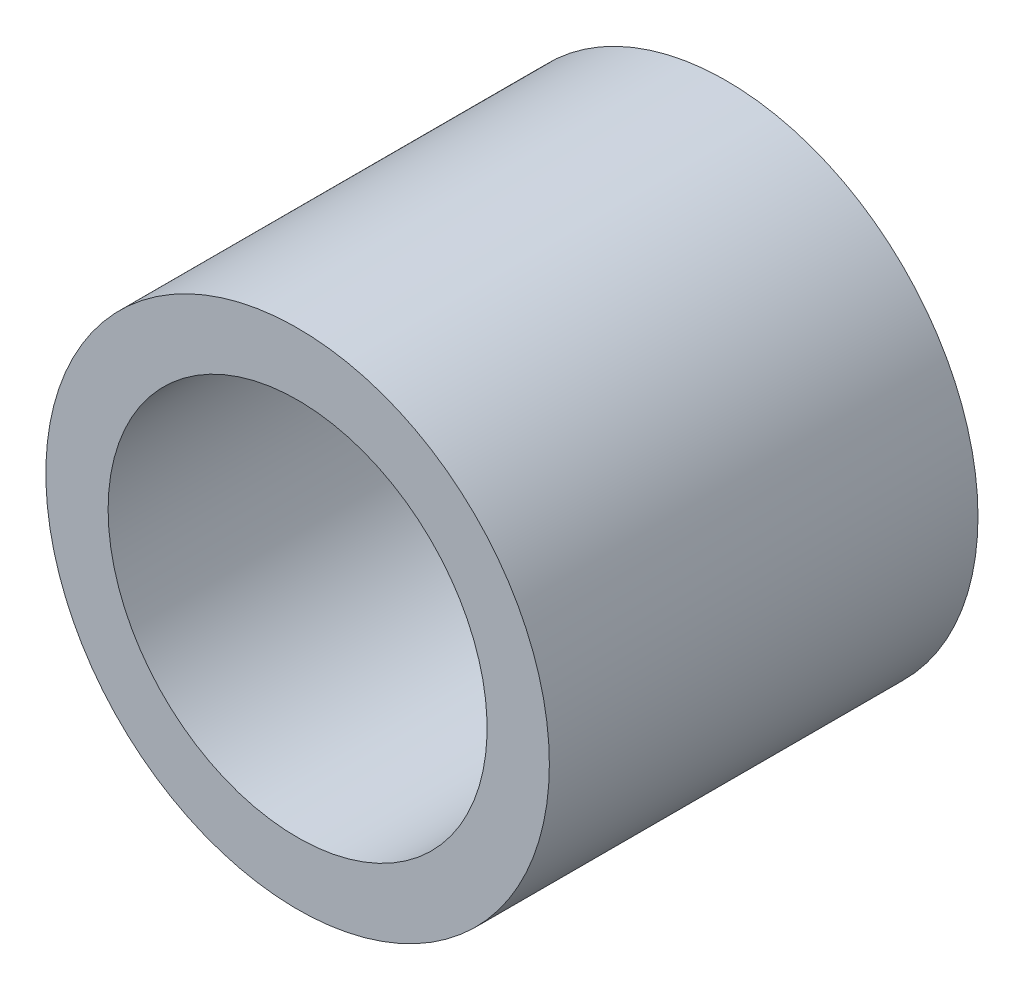
ISO-10303-21;
HEADER;
FILE_DESCRIPTION(('STEP AP214'),'2;1');
FILE_NAME('part.step','',(''),(''),'','','');
FILE_SCHEMA(('AUTOMOTIVE_DESIGN { 1 0 10303 214 1 1 1 1 }'));
ENDSEC;
DATA;
#1=APPLICATION_CONTEXT('core data for automotive mechanical design processes');
#2=APPLICATION_PROTOCOL_DEFINITION('international standard','automotive_design',2000,#1);
#3=PRODUCT_CONTEXT('',#1,'mechanical');
#4=PRODUCT('Part','Part','',(#3));
#5=PRODUCT_RELATED_PRODUCT_CATEGORY('part','',(#4));
#6=PRODUCT_DEFINITION_FORMATION('','',#4);
#7=PRODUCT_DEFINITION_CONTEXT('part definition',#1,'design');
#8=PRODUCT_DEFINITION('design','',#6,#7);
#9=PRODUCT_DEFINITION_SHAPE('','',#8);
#10=(LENGTH_UNIT() NAMED_UNIT(*) SI_UNIT(.MILLI.,.METRE.));
#11=(NAMED_UNIT(*) PLANE_ANGLE_UNIT() SI_UNIT($,.RADIAN.));
#12=(NAMED_UNIT(*) SI_UNIT($,.STERADIAN.) SOLID_ANGLE_UNIT());
#13=UNCERTAINTY_MEASURE_WITH_UNIT(LENGTH_MEASURE(1.E-05),#10,'distance_accuracy_value','');
#14=(GEOMETRIC_REPRESENTATION_CONTEXT(3) GLOBAL_UNCERTAINTY_ASSIGNED_CONTEXT((#13)) GLOBAL_UNIT_ASSIGNED_CONTEXT((#10,
#11,#12)) REPRESENTATION_CONTEXT('',''));
#15=CARTESIAN_POINT('',(0.,0.,0.));
#16=DIRECTION('',(0.,0.,1.));
#17=DIRECTION('',(1.,0.,0.));
#18=AXIS2_PLACEMENT_3D('',#15,#16,#17);
#19=CARTESIAN_POINT('',(0.,0.,47.5));
#20=DIRECTION('',(0.,0.,-1.));
#21=DIRECTION('',(-1.,0.,0.));
#22=AXIS2_PLACEMENT_3D('',#19,#20,#21);
#23=CYLINDRICAL_SURFACE('',#22,27.9);
#24=CARTESIAN_POINT('',(0.,0.,47.5));
#25=DIRECTION('',(0.,0.,1.));
#26=DIRECTION('',(1.,0.,0.));
#27=AXIS2_PLACEMENT_3D('',#24,#25,#26);
#28=CIRCLE('',#27,27.9);
#29=CARTESIAN_POINT('',(27.9,0.,47.5));
#30=VERTEX_POINT('',#29);
#31=EDGE_CURVE('E10',#30,#30,#28,.T.);
#32=ORIENTED_EDGE('',*,*,#31,.F.);
#33=EDGE_LOOP('',(#32));
#34=FACE_BOUND('',#33,.T.);
#35=CARTESIAN_POINT('',(0.,0.,0.));
#36=DIRECTION('',(0.,0.,1.));
#37=DIRECTION('',(1.,0.,0.));
#38=AXIS2_PLACEMENT_3D('',#35,#36,#37);
#39=CIRCLE('',#38,27.9);
#40=CARTESIAN_POINT('',(27.9,0.,0.));
#41=VERTEX_POINT('',#40);
#42=EDGE_CURVE('E33',#41,#41,#39,.T.);
#43=ORIENTED_EDGE('',*,*,#42,.T.);
#44=EDGE_LOOP('',(#43));
#45=FACE_BOUND('',#44,.T.);
#46=ADVANCED_FACE('F30',(#34,#45),#23,.T.);
#47=CARTESIAN_POINT('',(0.,0.,47.5));
#48=DIRECTION('',(0.,0.,1.));
#49=DIRECTION('',(1.,0.,0.));
#50=AXIS2_PLACEMENT_3D('',#47,#48,#49);
#51=PLANE('',#50);
#52=CARTESIAN_POINT('',(0.,0.,47.5));
#53=DIRECTION('',(0.,0.,-1.));
#54=DIRECTION('',(-1.,0.,0.));
#55=AXIS2_PLACEMENT_3D('',#52,#53,#54);
#56=CIRCLE('',#55,21.);
#57=CARTESIAN_POINT('',(-21.,0.,47.5));
#58=VERTEX_POINT('',#57);
#59=EDGE_CURVE('E40',#58,#58,#56,.T.);
#60=ORIENTED_EDGE('',*,*,#59,.T.);
#61=EDGE_LOOP('',(#60));
#62=FACE_BOUND('',#61,.T.);
#63=ORIENTED_EDGE('',*,*,#31,.T.);
#64=EDGE_LOOP('',(#63));
#65=FACE_BOUND('',#64,.T.);
#66=ADVANCED_FACE('F48',(#62,#65),#51,.T.);
#67=CARTESIAN_POINT('',(0.,0.,0.));
#68=DIRECTION('',(0.,0.,1.));
#69=DIRECTION('',(1.,0.,0.));
#70=AXIS2_PLACEMENT_3D('',#67,#68,#69);
#71=PLANE('',#70);
#72=CARTESIAN_POINT('',(0.,0.,0.));
#73=DIRECTION('',(0.,0.,-1.));
#74=DIRECTION('',(-1.,0.,0.));
#75=AXIS2_PLACEMENT_3D('',#72,#73,#74);
#76=CIRCLE('',#75,21.);
#77=CARTESIAN_POINT('',(-21.,0.,0.));
#78=VERTEX_POINT('',#77);
#79=EDGE_CURVE('E42',#78,#78,#76,.T.);
#80=ORIENTED_EDGE('',*,*,#79,.F.);
#81=EDGE_LOOP('',(#80));
#82=FACE_BOUND('',#81,.T.);
#83=ORIENTED_EDGE('',*,*,#42,.F.);
#84=EDGE_LOOP('',(#83));
#85=FACE_BOUND('',#84,.T.);
#86=ADVANCED_FACE('F53',(#82,#85),#71,.F.);
#87=CARTESIAN_POINT('',(0.,0.,47.5));
#88=DIRECTION('',(0.,0.,-1.));
#89=DIRECTION('',(-1.,0.,0.));
#90=AXIS2_PLACEMENT_3D('',#87,#88,#89);
#91=CYLINDRICAL_SURFACE('',#90,21.);
#92=ORIENTED_EDGE('',*,*,#59,.F.);
#93=EDGE_LOOP('',(#92));
#94=FACE_BOUND('',#93,.T.);
#95=ORIENTED_EDGE('',*,*,#79,.T.);
#96=EDGE_LOOP('',(#95));
#97=FACE_BOUND('',#96,.T.);
#98=ADVANCED_FACE('F50',(#94,#97),#91,.F.);
#99=CLOSED_SHELL('',(#46,#66,#86,#98));
#100=MANIFOLD_SOLID_BREP('B2',#99);
#101=ADVANCED_BREP_SHAPE_REPRESENTATION('',(#18,#100),#14);
#102=SHAPE_DEFINITION_REPRESENTATION(#9,#101);
ENDSEC;
END-ISO-10303-21;
